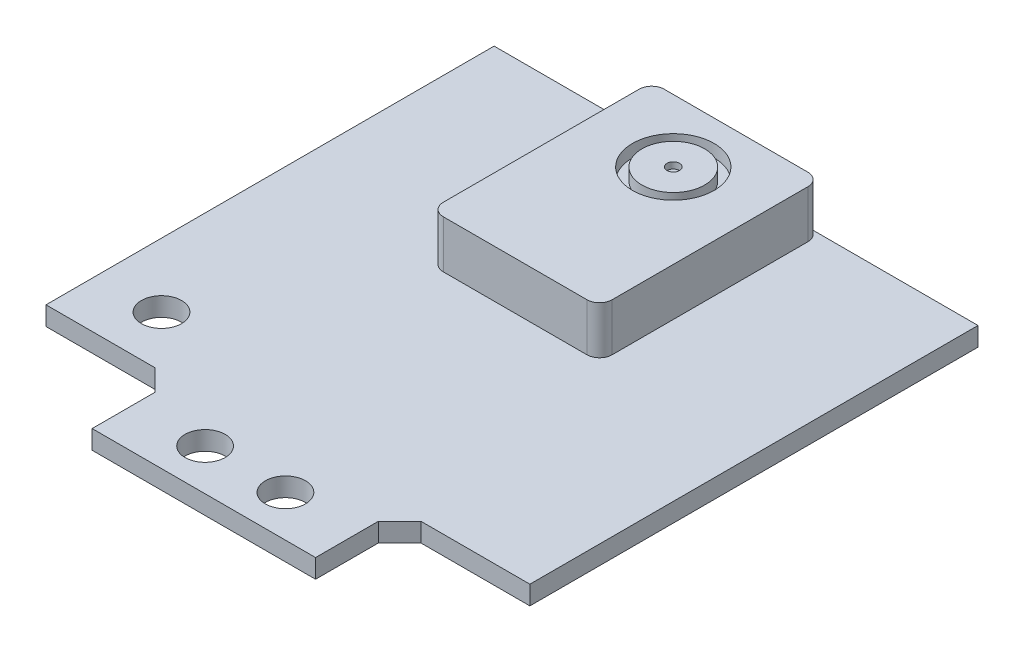
ISO-10303-21;
HEADER;
FILE_DESCRIPTION(('STEP AP214'),'2;1');
FILE_NAME('part.step','',(''),(''),'','','');
FILE_SCHEMA(('AUTOMOTIVE_DESIGN { 1 0 10303 214 1 1 1 1 }'));
ENDSEC;
DATA;
#1=APPLICATION_CONTEXT('core data for automotive mechanical design processes');
#2=APPLICATION_PROTOCOL_DEFINITION('international standard','automotive_design',2000,#1);
#3=PRODUCT_CONTEXT('',#1,'mechanical');
#4=PRODUCT('Part','Part','',(#3));
#5=PRODUCT_RELATED_PRODUCT_CATEGORY('part','',(#4));
#6=PRODUCT_DEFINITION_FORMATION('','',#4);
#7=PRODUCT_DEFINITION_CONTEXT('part definition',#1,'design');
#8=PRODUCT_DEFINITION('design','',#6,#7);
#9=PRODUCT_DEFINITION_SHAPE('','',#8);
#10=(LENGTH_UNIT() NAMED_UNIT(*) SI_UNIT(.MILLI.,.METRE.));
#11=(NAMED_UNIT(*) PLANE_ANGLE_UNIT() SI_UNIT($,.RADIAN.));
#12=(NAMED_UNIT(*) SI_UNIT($,.STERADIAN.) SOLID_ANGLE_UNIT());
#13=UNCERTAINTY_MEASURE_WITH_UNIT(LENGTH_MEASURE(1.E-05),#10,'distance_accuracy_value','');
#14=(GEOMETRIC_REPRESENTATION_CONTEXT(3) GLOBAL_UNCERTAINTY_ASSIGNED_CONTEXT((#13)) GLOBAL_UNIT_ASSIGNED_CONTEXT((#10,
#11,#12)) REPRESENTATION_CONTEXT('',''));
#15=CARTESIAN_POINT('',(0.,0.,0.));
#16=DIRECTION('',(0.,0.,1.));
#17=DIRECTION('',(1.,0.,0.));
#18=AXIS2_PLACEMENT_3D('',#15,#16,#17);
#19=CARTESIAN_POINT('',(0.,0.,0.));
#20=DIRECTION('',(0.,-1.,0.));
#21=DIRECTION('',(0.,0.,-1.));
#22=AXIS2_PLACEMENT_3D('',#19,#20,#21);
#23=PLANE('',#22);
#24=CARTESIAN_POINT('',(-3.19999999999999,0.,21.25));
#25=DIRECTION('',(0.,-1.,0.));
#26=DIRECTION('',(0.,0.,-1.));
#27=AXIS2_PLACEMENT_3D('',#24,#25,#26);
#28=CIRCLE('',#27,1.6);
#29=CARTESIAN_POINT('',(-3.19999999999999,0.,19.65));
#30=VERTEX_POINT('',#29);
#31=EDGE_CURVE('P0_E127',#30,#30,#28,.F.);
#32=ORIENTED_EDGE('',*,*,#31,.T.);
#33=EDGE_LOOP('',(#32));
#34=FACE_BOUND('',#33,.T.);
#35=DIRECTION('',(-1.,0.,0.));
#36=VECTOR('',#35,1.);
#37=CARTESIAN_POINT('',(-19.275,0.,17.85));
#38=LINE('',#37,#36);
#39=CARTESIAN_POINT('',(-10.6,0.,17.85));
#40=VERTEX_POINT('',#39);
#41=CARTESIAN_POINT('',(-19.275,0.,17.85));
#42=VERTEX_POINT('',#41);
#43=EDGE_CURVE('P0_E144',#40,#42,#38,.T.);
#44=ORIENTED_EDGE('',*,*,#43,.T.);
#45=DIRECTION('',(0.,0.,-1.));
#46=VECTOR('',#45,1.);
#47=CARTESIAN_POINT('',(-19.275,0.,-17.85));
#48=LINE('',#47,#46);
#49=CARTESIAN_POINT('',(-19.275,0.,-17.85));
#50=VERTEX_POINT('',#49);
#51=EDGE_CURVE('P0_E139',#42,#50,#48,.T.);
#52=ORIENTED_EDGE('',*,*,#51,.T.);
#53=DIRECTION('',(-1.,0.,0.));
#54=VECTOR('',#53,1.);
#55=CARTESIAN_POINT('',(-19.275,0.,-17.85));
#56=LINE('',#55,#54);
#57=CARTESIAN_POINT('',(19.275,0.,-17.85));
#58=VERTEX_POINT('',#57);
#59=EDGE_CURVE('P0_E109',#58,#50,#56,.T.);
#60=ORIENTED_EDGE('',*,*,#59,.F.);
#61=DIRECTION('',(0.,0.,-1.));
#62=VECTOR('',#61,1.);
#63=CARTESIAN_POINT('',(19.275,0.,-17.85));
#64=LINE('',#63,#62);
#65=CARTESIAN_POINT('',(19.275,0.,17.85));
#66=VERTEX_POINT('',#65);
#67=EDGE_CURVE('P0_E104',#66,#58,#64,.T.);
#68=ORIENTED_EDGE('',*,*,#67,.F.);
#69=DIRECTION('',(1.,0.,0.));
#70=VECTOR('',#69,1.);
#71=CARTESIAN_POINT('',(19.275,0.,17.85));
#72=LINE('',#71,#70);
#73=CARTESIAN_POINT('',(10.6,0.,17.85));
#74=VERTEX_POINT('',#73);
#75=EDGE_CURVE('P0_E95',#74,#66,#72,.T.);
#76=ORIENTED_EDGE('',*,*,#75,.F.);
#77=DIRECTION('',(0.707106781186547,0.,-0.707106781186548));
#78=VECTOR('',#77,1.);
#79=CARTESIAN_POINT('',(10.6,0.,17.85));
#80=LINE('',#79,#78);
#81=CARTESIAN_POINT('',(8.90000000000001,0.,19.55));
#82=VERTEX_POINT('',#81);
#83=EDGE_CURVE('P0_E90',#82,#74,#80,.T.);
#84=ORIENTED_EDGE('',*,*,#83,.F.);
#85=DIRECTION('',(0.,0.,-1.));
#86=VECTOR('',#85,1.);
#87=CARTESIAN_POINT('',(8.90000000000001,0.,19.55));
#88=LINE('',#87,#86);
#89=CARTESIAN_POINT('',(8.90000000000001,0.,24.55));
#90=VERTEX_POINT('',#89);
#91=EDGE_CURVE('P0_E166',#90,#82,#88,.T.);
#92=ORIENTED_EDGE('',*,*,#91,.F.);
#93=DIRECTION('',(-1.,0.,0.));
#94=VECTOR('',#93,1.);
#95=CARTESIAN_POINT('',(-8.89999999999999,0.,24.55));
#96=LINE('',#95,#94);
#97=CARTESIAN_POINT('',(-8.89999999999999,0.,24.55));
#98=VERTEX_POINT('',#97);
#99=EDGE_CURVE('P0_E159',#90,#98,#96,.T.);
#100=ORIENTED_EDGE('',*,*,#99,.T.);
#101=DIRECTION('',(0.,0.,-1.));
#102=VECTOR('',#101,1.);
#103=CARTESIAN_POINT('',(-8.9,0.,19.55));
#104=LINE('',#103,#102);
#105=CARTESIAN_POINT('',(-8.9,0.,19.55));
#106=VERTEX_POINT('',#105);
#107=EDGE_CURVE('P0_E154',#98,#106,#104,.T.);
#108=ORIENTED_EDGE('',*,*,#107,.T.);
#109=DIRECTION('',(-0.707106781186547,0.,-0.707106781186548));
#110=VECTOR('',#109,1.);
#111=CARTESIAN_POINT('',(-10.6,0.,17.85));
#112=LINE('',#111,#110);
#113=EDGE_CURVE('P0_E149',#106,#40,#112,.T.);
#114=ORIENTED_EDGE('',*,*,#113,.T.);
#115=EDGE_LOOP('',(#44,#52,#60,#68,#76,#84,#92,#100,#108,#114));
#116=FACE_BOUND('',#115,.T.);
#117=CARTESIAN_POINT('',(-14.175,0.,13.75));
#118=DIRECTION('',(0.,-1.,0.));
#119=DIRECTION('',(0.,0.,-1.));
#120=AXIS2_PLACEMENT_3D('',#117,#118,#119);
#121=CIRCLE('',#120,1.6);
#122=CARTESIAN_POINT('',(-14.175,0.,12.15));
#123=VERTEX_POINT('',#122);
#124=EDGE_CURVE('P0_E129',#123,#123,#121,.F.);
#125=ORIENTED_EDGE('',*,*,#124,.T.);
#126=EDGE_LOOP('',(#125));
#127=FACE_BOUND('',#126,.T.);
#128=CARTESIAN_POINT('',(3.20000000000001,0.,21.25));
#129=DIRECTION('',(0.,-1.,0.));
#130=DIRECTION('',(0.,0.,-1.));
#131=AXIS2_PLACEMENT_3D('',#128,#129,#130);
#132=CIRCLE('',#131,1.6);
#133=CARTESIAN_POINT('',(3.20000000000001,0.,19.65));
#134=VERTEX_POINT('',#133);
#135=EDGE_CURVE('P0_E19',#134,#134,#132,.F.);
#136=ORIENTED_EDGE('',*,*,#135,.T.);
#137=EDGE_LOOP('',(#136));
#138=FACE_BOUND('',#137,.T.);
#139=ADVANCED_FACE('P0_F16',(#34,#116,#127,#138),#23,.T.);
#140=CARTESIAN_POINT('',(3.20000000000001,1.5,21.25));
#141=DIRECTION('',(0.,-1.,0.));
#142=DIRECTION('',(0.,0.,-1.));
#143=AXIS2_PLACEMENT_3D('',#140,#141,#142);
#144=CYLINDRICAL_SURFACE('',#143,1.6);
#145=CARTESIAN_POINT('',(3.20000000000001,1.5,21.25));
#146=DIRECTION('',(0.,-1.,0.));
#147=DIRECTION('',(0.,0.,-1.));
#148=AXIS2_PLACEMENT_3D('',#145,#146,#147);
#149=CIRCLE('',#148,1.6);
#150=CARTESIAN_POINT('',(3.20000000000001,1.5,19.65));
#151=VERTEX_POINT('',#150);
#152=EDGE_CURVE('P0_E124',#151,#151,#149,.F.);
#153=ORIENTED_EDGE('',*,*,#152,.T.);
#154=EDGE_LOOP('',(#153));
#155=FACE_BOUND('',#154,.T.);
#156=ORIENTED_EDGE('',*,*,#135,.F.);
#157=EDGE_LOOP('',(#156));
#158=FACE_BOUND('',#157,.T.);
#159=ADVANCED_FACE('P0_F334',(#155,#158),#144,.F.);
#160=CARTESIAN_POINT('',(19.275,1.5,-17.85));
#161=DIRECTION('',(1.,0.,0.));
#162=DIRECTION('',(0.,0.,-1.));
#163=AXIS2_PLACEMENT_3D('',#160,#161,#162);
#164=PLANE('',#163);
#165=DIRECTION('',(0.,0.,-1.));
#166=VECTOR('',#165,1.);
#167=CARTESIAN_POINT('',(19.275,1.5,0.));
#168=LINE('',#167,#166);
#169=CARTESIAN_POINT('',(19.275,1.5,-17.85));
#170=VERTEX_POINT('',#169);
#171=CARTESIAN_POINT('',(19.275,1.5,17.85));
#172=VERTEX_POINT('',#171);
#173=EDGE_CURVE('P0_E116',#170,#172,#168,.F.);
#174=ORIENTED_EDGE('',*,*,#173,.T.);
#175=DIRECTION('',(0.,1.,0.));
#176=VECTOR('',#175,1.);
#177=CARTESIAN_POINT('',(19.275,1.5,17.85));
#178=LINE('',#177,#176);
#179=EDGE_CURVE('P0_E100',#66,#172,#178,.T.);
#180=ORIENTED_EDGE('',*,*,#179,.F.);
#181=ORIENTED_EDGE('',*,*,#67,.T.);
#182=DIRECTION('',(0.,1.,0.));
#183=VECTOR('',#182,1.);
#184=CARTESIAN_POINT('',(19.275,1.5,-17.85));
#185=LINE('',#184,#183);
#186=EDGE_CURVE('P0_E131',#170,#58,#185,.F.);
#187=ORIENTED_EDGE('',*,*,#186,.F.);
#188=EDGE_LOOP('',(#174,#180,#181,#187));
#189=FACE_BOUND('',#188,.T.);
#190=ADVANCED_FACE('P0_F115',(#189),#164,.T.);
#191=CARTESIAN_POINT('',(19.275,1.5,17.85));
#192=DIRECTION('',(0.,0.,1.));
#193=DIRECTION('',(1.,0.,0.));
#194=AXIS2_PLACEMENT_3D('',#191,#192,#193);
#195=PLANE('',#194);
#196=DIRECTION('',(1.,0.,0.));
#197=VECTOR('',#196,1.);
#198=CARTESIAN_POINT('',(0.,1.5,17.85));
#199=LINE('',#198,#197);
#200=CARTESIAN_POINT('',(10.6,1.5,17.85));
#201=VERTEX_POINT('',#200);
#202=EDGE_CURVE('P0_E176',#172,#201,#199,.F.);
#203=ORIENTED_EDGE('',*,*,#202,.T.);
#204=DIRECTION('',(0.,1.,0.));
#205=VECTOR('',#204,1.);
#206=CARTESIAN_POINT('',(10.6,1.5,17.85));
#207=LINE('',#206,#205);
#208=EDGE_CURVE('P0_E102',#74,#201,#207,.T.);
#209=ORIENTED_EDGE('',*,*,#208,.F.);
#210=ORIENTED_EDGE('',*,*,#75,.T.);
#211=ORIENTED_EDGE('',*,*,#179,.T.);
#212=EDGE_LOOP('',(#203,#209,#210,#211));
#213=FACE_BOUND('',#212,.T.);
#214=ADVANCED_FACE('P0_F98',(#213),#195,.T.);
#215=CARTESIAN_POINT('',(10.6,1.5,17.85));
#216=DIRECTION('',(0.707106781186548,0.,0.707106781186547));
#217=DIRECTION('',(0.707106781186547,0.,-0.707106781186548));
#218=AXIS2_PLACEMENT_3D('',#215,#216,#217);
#219=PLANE('',#218);
#220=DIRECTION('',(-0.707106781186547,0.,0.707106781186548));
#221=VECTOR('',#220,1.);
#222=CARTESIAN_POINT('',(10.6,1.5,17.85));
#223=LINE('',#222,#221);
#224=CARTESIAN_POINT('',(8.90000000000001,1.5,19.55));
#225=VERTEX_POINT('',#224);
#226=EDGE_CURVE('P0_E170',#201,#225,#223,.T.);
#227=ORIENTED_EDGE('',*,*,#226,.T.);
#228=DIRECTION('',(0.,1.,0.));
#229=VECTOR('',#228,1.);
#230=CARTESIAN_POINT('',(8.90000000000001,1.5,19.55));
#231=LINE('',#230,#229);
#232=EDGE_CURVE('P0_E164',#82,#225,#231,.T.);
#233=ORIENTED_EDGE('',*,*,#232,.F.);
#234=ORIENTED_EDGE('',*,*,#83,.T.);
#235=ORIENTED_EDGE('',*,*,#208,.T.);
#236=EDGE_LOOP('',(#227,#233,#234,#235));
#237=FACE_BOUND('',#236,.T.);
#238=ADVANCED_FACE('P0_F169',(#237),#219,.T.);
#239=CARTESIAN_POINT('',(8.90000000000001,1.5,19.55));
#240=DIRECTION('',(1.,0.,0.));
#241=DIRECTION('',(0.,0.,-1.));
#242=AXIS2_PLACEMENT_3D('',#239,#240,#241);
#243=PLANE('',#242);
#244=DIRECTION('',(0.,0.,-1.));
#245=VECTOR('',#244,1.);
#246=CARTESIAN_POINT('',(8.90000000000001,1.5,0.));
#247=LINE('',#246,#245);
#248=CARTESIAN_POINT('',(8.90000000000001,1.5,24.55));
#249=VERTEX_POINT('',#248);
#250=EDGE_CURVE('P0_E179',#225,#249,#247,.F.);
#251=ORIENTED_EDGE('',*,*,#250,.T.);
#252=DIRECTION('',(0.,1.,0.));
#253=VECTOR('',#252,1.);
#254=CARTESIAN_POINT('',(8.90000000000001,1.5,24.55));
#255=LINE('',#254,#253);
#256=EDGE_CURVE('P0_E161',#249,#90,#255,.F.);
#257=ORIENTED_EDGE('',*,*,#256,.T.);
#258=ORIENTED_EDGE('',*,*,#91,.T.);
#259=ORIENTED_EDGE('',*,*,#232,.T.);
#260=EDGE_LOOP('',(#251,#257,#258,#259));
#261=FACE_BOUND('',#260,.T.);
#262=ADVANCED_FACE('P0_F218',(#261),#243,.T.);
#263=CARTESIAN_POINT('',(-8.89999999999999,1.5,24.55));
#264=DIRECTION('',(0.,0.,-1.));
#265=DIRECTION('',(-1.,0.,0.));
#266=AXIS2_PLACEMENT_3D('',#263,#264,#265);
#267=PLANE('',#266);
#268=ORIENTED_EDGE('',*,*,#256,.F.);
#269=DIRECTION('',(1.,0.,0.));
#270=VECTOR('',#269,1.);
#271=CARTESIAN_POINT('',(0.,1.5,24.55));
#272=LINE('',#271,#270);
#273=CARTESIAN_POINT('',(-8.89999999999999,1.5,24.55));
#274=VERTEX_POINT('',#273);
#275=EDGE_CURVE('P0_E183',#249,#274,#272,.F.);
#276=ORIENTED_EDGE('',*,*,#275,.T.);
#277=DIRECTION('',(0.,1.,0.));
#278=VECTOR('',#277,1.);
#279=CARTESIAN_POINT('',(-8.89999999999999,1.5,24.55));
#280=LINE('',#279,#278);
#281=EDGE_CURVE('P0_E156',#274,#98,#280,.F.);
#282=ORIENTED_EDGE('',*,*,#281,.T.);
#283=ORIENTED_EDGE('',*,*,#99,.F.);
#284=EDGE_LOOP('',(#268,#276,#282,#283));
#285=FACE_BOUND('',#284,.T.);
#286=ADVANCED_FACE('P0_F215',(#285),#267,.F.);
#287=CARTESIAN_POINT('',(-8.9,1.5,19.55));
#288=DIRECTION('',(1.,0.,0.));
#289=DIRECTION('',(0.,0.,-1.));
#290=AXIS2_PLACEMENT_3D('',#287,#288,#289);
#291=PLANE('',#290);
#292=ORIENTED_EDGE('',*,*,#281,.F.);
#293=DIRECTION('',(0.,0.,-1.));
#294=VECTOR('',#293,1.);
#295=CARTESIAN_POINT('',(-8.89999999999999,1.5,0.));
#296=LINE('',#295,#294);
#297=CARTESIAN_POINT('',(-8.9,1.5,19.55));
#298=VERTEX_POINT('',#297);
#299=EDGE_CURVE('P0_E186',#274,#298,#296,.T.);
#300=ORIENTED_EDGE('',*,*,#299,.T.);
#301=DIRECTION('',(0.,1.,0.));
#302=VECTOR('',#301,1.);
#303=CARTESIAN_POINT('',(-8.9,1.5,19.55));
#304=LINE('',#303,#302);
#305=EDGE_CURVE('P0_E151',#298,#106,#304,.F.);
#306=ORIENTED_EDGE('',*,*,#305,.T.);
#307=ORIENTED_EDGE('',*,*,#107,.F.);
#308=EDGE_LOOP('',(#292,#300,#306,#307));
#309=FACE_BOUND('',#308,.T.);
#310=ADVANCED_FACE('P0_F213',(#309),#291,.F.);
#311=CARTESIAN_POINT('',(-10.6,1.5,17.85));
#312=DIRECTION('',(0.707106781186548,0.,-0.707106781186547));
#313=DIRECTION('',(-0.707106781186547,0.,-0.707106781186548));
#314=AXIS2_PLACEMENT_3D('',#311,#312,#313);
#315=PLANE('',#314);
#316=ORIENTED_EDGE('',*,*,#305,.F.);
#317=DIRECTION('',(-0.707106781186547,0.,-0.707106781186548));
#318=VECTOR('',#317,1.);
#319=CARTESIAN_POINT('',(-8.9,1.5,19.55));
#320=LINE('',#319,#318);
#321=CARTESIAN_POINT('',(-10.6,1.5,17.85));
#322=VERTEX_POINT('',#321);
#323=EDGE_CURVE('P0_E189',#298,#322,#320,.T.);
#324=ORIENTED_EDGE('',*,*,#323,.T.);
#325=DIRECTION('',(0.,1.,0.));
#326=VECTOR('',#325,1.);
#327=CARTESIAN_POINT('',(-10.6,1.5,17.85));
#328=LINE('',#327,#326);
#329=EDGE_CURVE('P0_E146',#322,#40,#328,.F.);
#330=ORIENTED_EDGE('',*,*,#329,.T.);
#331=ORIENTED_EDGE('',*,*,#113,.F.);
#332=EDGE_LOOP('',(#316,#324,#330,#331));
#333=FACE_BOUND('',#332,.T.);
#334=ADVANCED_FACE('P0_F209',(#333),#315,.F.);
#335=CARTESIAN_POINT('',(-19.275,1.5,17.85));
#336=DIRECTION('',(0.,0.,-1.));
#337=DIRECTION('',(-1.,0.,0.));
#338=AXIS2_PLACEMENT_3D('',#335,#336,#337);
#339=PLANE('',#338);
#340=ORIENTED_EDGE('',*,*,#329,.F.);
#341=DIRECTION('',(1.,0.,0.));
#342=VECTOR('',#341,1.);
#343=CARTESIAN_POINT('',(0.,1.5,17.85));
#344=LINE('',#343,#342);
#345=CARTESIAN_POINT('',(-19.275,1.5,17.85));
#346=VERTEX_POINT('',#345);
#347=EDGE_CURVE('P0_E192',#322,#346,#344,.F.);
#348=ORIENTED_EDGE('',*,*,#347,.T.);
#349=DIRECTION('',(0.,1.,0.));
#350=VECTOR('',#349,1.);
#351=CARTESIAN_POINT('',(-19.275,1.5,17.85));
#352=LINE('',#351,#350);
#353=EDGE_CURVE('P0_E141',#346,#42,#352,.F.);
#354=ORIENTED_EDGE('',*,*,#353,.T.);
#355=ORIENTED_EDGE('',*,*,#43,.F.);
#356=EDGE_LOOP('',(#340,#348,#354,#355));
#357=FACE_BOUND('',#356,.T.);
#358=ADVANCED_FACE('P0_F205',(#357),#339,.F.);
#359=CARTESIAN_POINT('',(-19.275,1.5,-17.85));
#360=DIRECTION('',(1.,0.,0.));
#361=DIRECTION('',(0.,0.,-1.));
#362=AXIS2_PLACEMENT_3D('',#359,#360,#361);
#363=PLANE('',#362);
#364=ORIENTED_EDGE('',*,*,#353,.F.);
#365=DIRECTION('',(0.,0.,-1.));
#366=VECTOR('',#365,1.);
#367=CARTESIAN_POINT('',(-19.275,1.5,0.));
#368=LINE('',#367,#366);
#369=CARTESIAN_POINT('',(-19.275,1.5,-17.85));
#370=VERTEX_POINT('',#369);
#371=EDGE_CURVE('P0_E195',#346,#370,#368,.T.);
#372=ORIENTED_EDGE('',*,*,#371,.T.);
#373=DIRECTION('',(0.,1.,0.));
#374=VECTOR('',#373,1.);
#375=CARTESIAN_POINT('',(-19.275,1.5,-17.85));
#376=LINE('',#375,#374);
#377=EDGE_CURVE('P0_E34',#50,#370,#376,.T.);
#378=ORIENTED_EDGE('',*,*,#377,.F.);
#379=ORIENTED_EDGE('',*,*,#51,.F.);
#380=EDGE_LOOP('',(#364,#372,#378,#379));
#381=FACE_BOUND('',#380,.T.);
#382=ADVANCED_FACE('P0_F201',(#381),#363,.F.);
#383=CARTESIAN_POINT('',(-19.275,1.5,-17.85));
#384=DIRECTION('',(0.,0.,-1.));
#385=DIRECTION('',(-1.,0.,0.));
#386=AXIS2_PLACEMENT_3D('',#383,#384,#385);
#387=PLANE('',#386);
#388=DIRECTION('',(1.,0.,0.));
#389=VECTOR('',#388,1.);
#390=CARTESIAN_POINT('',(0.,1.5,-17.85));
#391=LINE('',#390,#389);
#392=EDGE_CURVE('P0_E123',#370,#170,#391,.T.);
#393=ORIENTED_EDGE('',*,*,#392,.T.);
#394=ORIENTED_EDGE('',*,*,#186,.T.);
#395=ORIENTED_EDGE('',*,*,#59,.T.);
#396=ORIENTED_EDGE('',*,*,#377,.T.);
#397=EDGE_LOOP('',(#393,#394,#395,#396));
#398=FACE_BOUND('',#397,.T.);
#399=ADVANCED_FACE('P0_F198',(#398),#387,.T.);
#400=CARTESIAN_POINT('',(-14.175,1.5,13.75));
#401=DIRECTION('',(0.,-1.,0.));
#402=DIRECTION('',(0.,0.,-1.));
#403=AXIS2_PLACEMENT_3D('',#400,#401,#402);
#404=CYLINDRICAL_SURFACE('',#403,1.6);
#405=ORIENTED_EDGE('',*,*,#124,.F.);
#406=EDGE_LOOP('',(#405));
#407=FACE_BOUND('',#406,.T.);
#408=CARTESIAN_POINT('',(-14.175,1.5,13.75));
#409=DIRECTION('',(0.,-1.,0.));
#410=DIRECTION('',(0.,0.,-1.));
#411=AXIS2_PLACEMENT_3D('',#408,#409,#410);
#412=CIRCLE('',#411,1.6);
#413=CARTESIAN_POINT('',(-14.175,1.5,12.15));
#414=VERTEX_POINT('',#413);
#415=EDGE_CURVE('P0_E25',#414,#414,#412,.F.);
#416=ORIENTED_EDGE('',*,*,#415,.T.);
#417=EDGE_LOOP('',(#416));
#418=FACE_BOUND('',#417,.T.);
#419=ADVANCED_FACE('P0_F235',(#407,#418),#404,.F.);
#420=CARTESIAN_POINT('',(-3.19999999999999,1.5,21.25));
#421=DIRECTION('',(0.,-1.,0.));
#422=DIRECTION('',(0.,0.,-1.));
#423=AXIS2_PLACEMENT_3D('',#420,#421,#422);
#424=CYLINDRICAL_SURFACE('',#423,1.6);
#425=ORIENTED_EDGE('',*,*,#31,.F.);
#426=EDGE_LOOP('',(#425));
#427=FACE_BOUND('',#426,.T.);
#428=CARTESIAN_POINT('',(-3.19999999999999,1.5,21.25));
#429=DIRECTION('',(0.,-1.,0.));
#430=DIRECTION('',(0.,0.,-1.));
#431=AXIS2_PLACEMENT_3D('',#428,#429,#430);
#432=CIRCLE('',#431,1.6);
#433=CARTESIAN_POINT('',(-3.19999999999999,1.5,19.65));
#434=VERTEX_POINT('',#433);
#435=EDGE_CURVE('P0_E11',#434,#434,#432,.F.);
#436=ORIENTED_EDGE('',*,*,#435,.T.);
#437=EDGE_LOOP('',(#436));
#438=FACE_BOUND('',#437,.T.);
#439=ADVANCED_FACE('P0_F229',(#427,#438),#424,.F.);
#440=CARTESIAN_POINT('',(0.,1.5,0.));
#441=DIRECTION('',(0.,-1.,0.));
#442=DIRECTION('',(0.,0.,-1.));
#443=AXIS2_PLACEMENT_3D('',#440,#441,#442);
#444=PLANE('',#443);
#445=ORIENTED_EDGE('',*,*,#435,.F.);
#446=EDGE_LOOP('',(#445));
#447=FACE_BOUND('',#446,.T.);
#448=ORIENTED_EDGE('',*,*,#415,.F.);
#449=EDGE_LOOP('',(#448));
#450=FACE_BOUND('',#449,.T.);
#451=ORIENTED_EDGE('',*,*,#371,.F.);
#452=ORIENTED_EDGE('',*,*,#347,.F.);
#453=ORIENTED_EDGE('',*,*,#323,.F.);
#454=ORIENTED_EDGE('',*,*,#299,.F.);
#455=ORIENTED_EDGE('',*,*,#275,.F.);
#456=ORIENTED_EDGE('',*,*,#250,.F.);
#457=ORIENTED_EDGE('',*,*,#226,.F.);
#458=ORIENTED_EDGE('',*,*,#202,.F.);
#459=ORIENTED_EDGE('',*,*,#173,.F.);
#460=ORIENTED_EDGE('',*,*,#392,.F.);
#461=EDGE_LOOP('',(#451,#452,#453,#454,#455,#456,#457,#458,#459,#460));
#462=FACE_BOUND('',#461,.T.);
#463=ORIENTED_EDGE('',*,*,#152,.F.);
#464=EDGE_LOOP('',(#463));
#465=FACE_BOUND('',#464,.T.);
#466=ADVANCED_FACE('P0_F174',(#447,#450,#462,#465),#444,.F.);
#467=CLOSED_SHELL('',(#139,#159,#190,#214,#238,#262,#286,#310,#334,#358,#382,#399,#419,#439,#466));
#468=MANIFOLD_SOLID_BREP('P0_B1',#467);
#469=CARTESIAN_POINT('',(0.,4.8,-12.85));
#470=DIRECTION('',(0.,1.,0.));
#471=DIRECTION('',(0.,0.,1.));
#472=AXIS2_PLACEMENT_3D('',#469,#470,#471);
#473=PLANE('',#472);
#474=CARTESIAN_POINT('',(0.,4.8,-12.85));
#475=DIRECTION('',(0.,1.,0.));
#476=DIRECTION('',(0.,0.,1.));
#477=AXIS2_PLACEMENT_3D('',#474,#475,#476);
#478=CIRCLE('',#477,0.5);
#479=CARTESIAN_POINT('',(0.,4.8,-12.35));
#480=VERTEX_POINT('',#479);
#481=EDGE_CURVE('P1_E19',#480,#480,#478,.T.);
#482=ORIENTED_EDGE('',*,*,#481,.T.);
#483=EDGE_LOOP('',(#482));
#484=FACE_BOUND('',#483,.T.);
#485=ADVANCED_FACE('P1_F16',(#484),#473,.T.);
#486=CARTESIAN_POINT('',(0.,4.8,-12.85));
#487=DIRECTION('',(0.,1.,0.));
#488=DIRECTION('',(0.,0.,1.));
#489=AXIS2_PLACEMENT_3D('',#486,#487,#488);
#490=CYLINDRICAL_SURFACE('',#489,0.5);
#491=ORIENTED_EDGE('',*,*,#481,.F.);
#492=EDGE_LOOP('',(#491));
#493=FACE_BOUND('',#492,.T.);
#494=CARTESIAN_POINT('',(0.,5.3,-12.85));
#495=DIRECTION('',(0.,1.,0.));
#496=DIRECTION('',(0.,0.,1.));
#497=AXIS2_PLACEMENT_3D('',#494,#495,#496);
#498=CIRCLE('',#497,0.5);
#499=CARTESIAN_POINT('',(0.,5.3,-12.35));
#500=VERTEX_POINT('',#499);
#501=EDGE_CURVE('P1_E151',#500,#500,#498,.T.);
#502=ORIENTED_EDGE('',*,*,#501,.T.);
#503=EDGE_LOOP('',(#502));
#504=FACE_BOUND('',#503,.T.);
#505=ADVANCED_FACE('P1_F159',(#493,#504),#490,.F.);
#506=CARTESIAN_POINT('',(5.725,5.3,-16.85));
#507=DIRECTION('',(0.,-1.,0.));
#508=DIRECTION('',(0.,0.,-1.));
#509=AXIS2_PLACEMENT_3D('',#506,#507,#508);
#510=PLANE('',#509);
#511=CARTESIAN_POINT('',(0.,5.3,-12.85));
#512=DIRECTION('',(0.,1.,0.));
#513=DIRECTION('',(0.,0.,1.));
#514=AXIS2_PLACEMENT_3D('',#511,#512,#513);
#515=CIRCLE('',#514,2.5);
#516=CARTESIAN_POINT('',(0.,5.3,-10.35));
#517=VERTEX_POINT('',#516);
#518=EDGE_CURVE('P1_E149',#517,#517,#515,.F.);
#519=ORIENTED_EDGE('',*,*,#518,.F.);
#520=EDGE_LOOP('',(#519));
#521=FACE_BOUND('',#520,.T.);
#522=ORIENTED_EDGE('',*,*,#501,.F.);
#523=EDGE_LOOP('',(#522));
#524=FACE_BOUND('',#523,.T.);
#525=ADVANCED_FACE('P1_F161',(#521,#524),#510,.F.);
#526=CARTESIAN_POINT('',(0.,4.3,-12.85));
#527=DIRECTION('',(0.,1.,0.));
#528=DIRECTION('',(0.,0.,1.));
#529=AXIS2_PLACEMENT_3D('',#526,#527,#528);
#530=CYLINDRICAL_SURFACE('',#529,2.5);
#531=CARTESIAN_POINT('',(0.,4.3,-12.85));
#532=DIRECTION('',(0.,1.,0.));
#533=DIRECTION('',(0.,0.,1.));
#534=AXIS2_PLACEMENT_3D('',#531,#532,#533);
#535=CIRCLE('',#534,2.5);
#536=CARTESIAN_POINT('',(0.,4.3,-10.35));
#537=VERTEX_POINT('',#536);
#538=EDGE_CURVE('P1_E146',#537,#537,#535,.T.);
#539=ORIENTED_EDGE('',*,*,#538,.T.);
#540=EDGE_LOOP('',(#539));
#541=FACE_BOUND('',#540,.T.);
#542=ORIENTED_EDGE('',*,*,#518,.T.);
#543=EDGE_LOOP('',(#542));
#544=FACE_BOUND('',#543,.T.);
#545=ADVANCED_FACE('P1_F167',(#541,#544),#530,.T.);
#546=CARTESIAN_POINT('',(0.,4.3,-12.85));
#547=DIRECTION('',(0.,-1.,0.));
#548=DIRECTION('',(0.,0.,-1.));
#549=AXIS2_PLACEMENT_3D('',#546,#547,#548);
#550=PLANE('',#549);
#551=ORIENTED_EDGE('',*,*,#538,.F.);
#552=EDGE_LOOP('',(#551));
#553=FACE_BOUND('',#552,.T.);
#554=CARTESIAN_POINT('',(0.,4.3,-12.85));
#555=DIRECTION('',(0.,1.,0.));
#556=DIRECTION('',(0.,0.,1.));
#557=AXIS2_PLACEMENT_3D('',#554,#555,#556);
#558=CIRCLE('',#557,3.25);
#559=CARTESIAN_POINT('',(0.,4.3,-9.6));
#560=VERTEX_POINT('',#559);
#561=EDGE_CURVE('P1_E143',#560,#560,#558,.T.);
#562=ORIENTED_EDGE('',*,*,#561,.T.);
#563=EDGE_LOOP('',(#562));
#564=FACE_BOUND('',#563,.T.);
#565=ADVANCED_FACE('P1_F208',(#553,#564),#550,.F.);
#566=CARTESIAN_POINT('',(0.,4.3,-12.85));
#567=DIRECTION('',(0.,1.,0.));
#568=DIRECTION('',(0.,0.,1.));
#569=AXIS2_PLACEMENT_3D('',#566,#567,#568);
#570=CYLINDRICAL_SURFACE('',#569,3.25);
#571=CARTESIAN_POINT('',(0.,5.3,-12.85));
#572=DIRECTION('',(0.,1.,0.));
#573=DIRECTION('',(0.,0.,1.));
#574=AXIS2_PLACEMENT_3D('',#571,#572,#573);
#575=CIRCLE('',#574,3.25);
#576=CARTESIAN_POINT('',(0.,5.3,-9.6));
#577=VERTEX_POINT('',#576);
#578=EDGE_CURVE('P1_E98',#577,#577,#575,.T.);
#579=ORIENTED_EDGE('',*,*,#578,.T.);
#580=EDGE_LOOP('',(#579));
#581=FACE_BOUND('',#580,.T.);
#582=ORIENTED_EDGE('',*,*,#561,.F.);
#583=EDGE_LOOP('',(#582));
#584=FACE_BOUND('',#583,.T.);
#585=ADVANCED_FACE('P1_F205',(#581,#584),#570,.F.);
#586=CARTESIAN_POINT('',(5.725,5.3,-1.25));
#587=DIRECTION('',(0.,-1.,0.));
#588=DIRECTION('',(0.,0.,-1.));
#589=AXIS2_PLACEMENT_3D('',#586,#587,#588);
#590=CYLINDRICAL_SURFACE('',#589,1.);
#591=CARTESIAN_POINT('',(5.725,5.3,-1.25));
#592=DIRECTION('',(0.,-1.,0.));
#593=DIRECTION('',(0.,0.,-1.));
#594=AXIS2_PLACEMENT_3D('',#591,#592,#593);
#595=CIRCLE('',#594,1.);
#596=CARTESIAN_POINT('',(6.725,5.3,-1.25));
#597=VERTEX_POINT('',#596);
#598=CARTESIAN_POINT('',(5.725,5.3,-0.25));
#599=VERTEX_POINT('',#598);
#600=EDGE_CURVE('P1_E88',#597,#599,#595,.T.);
#601=ORIENTED_EDGE('',*,*,#600,.T.);
#602=DIRECTION('',(0.,1.,0.));
#603=VECTOR('',#602,1.);
#604=CARTESIAN_POINT('',(5.725,5.3,-0.25));
#605=LINE('',#604,#603);
#606=CARTESIAN_POINT('',(5.725,1.5,-0.25));
#607=VERTEX_POINT('',#606);
#608=EDGE_CURVE('P1_E92',#607,#599,#605,.T.);
#609=ORIENTED_EDGE('',*,*,#608,.F.);
#610=CARTESIAN_POINT('',(5.725,1.5,-1.25));
#611=DIRECTION('',(0.,-1.,0.));
#612=DIRECTION('',(0.,0.,-1.));
#613=AXIS2_PLACEMENT_3D('',#610,#611,#612);
#614=CIRCLE('',#613,1.);
#615=CARTESIAN_POINT('',(6.725,1.5,-1.25));
#616=VERTEX_POINT('',#615);
#617=EDGE_CURVE('P1_E54',#607,#616,#614,.F.);
#618=ORIENTED_EDGE('',*,*,#617,.T.);
#619=DIRECTION('',(0.,1.,0.));
#620=VECTOR('',#619,1.);
#621=CARTESIAN_POINT('',(6.725,5.3,-1.25));
#622=LINE('',#621,#620);
#623=EDGE_CURVE('P1_E94',#616,#597,#622,.T.);
#624=ORIENTED_EDGE('',*,*,#623,.T.);
#625=EDGE_LOOP('',(#601,#609,#618,#624));
#626=FACE_BOUND('',#625,.T.);
#627=ADVANCED_FACE('P1_F90',(#626),#590,.T.);
#628=CARTESIAN_POINT('',(-5.725,5.3,-1.25));
#629=DIRECTION('',(0.,-1.,0.));
#630=DIRECTION('',(0.,0.,-1.));
#631=AXIS2_PLACEMENT_3D('',#628,#629,#630);
#632=CYLINDRICAL_SURFACE('',#631,1.);
#633=CARTESIAN_POINT('',(-5.725,5.3,-1.25));
#634=DIRECTION('',(0.,-1.,0.));
#635=DIRECTION('',(0.,0.,-1.));
#636=AXIS2_PLACEMENT_3D('',#633,#634,#635);
#637=CIRCLE('',#636,1.);
#638=CARTESIAN_POINT('',(-5.725,5.3,-0.249999999999999));
#639=VERTEX_POINT('',#638);
#640=CARTESIAN_POINT('',(-6.725,5.3,-1.25));
#641=VERTEX_POINT('',#640);
#642=EDGE_CURVE('P1_E97',#639,#641,#637,.T.);
#643=ORIENTED_EDGE('',*,*,#642,.T.);
#644=DIRECTION('',(0.,1.,0.));
#645=VECTOR('',#644,1.);
#646=CARTESIAN_POINT('',(-6.725,5.3,-1.25));
#647=LINE('',#646,#645);
#648=CARTESIAN_POINT('',(-6.725,1.5,-1.25));
#649=VERTEX_POINT('',#648);
#650=EDGE_CURVE('P1_E120',#649,#641,#647,.T.);
#651=ORIENTED_EDGE('',*,*,#650,.F.);
#652=CARTESIAN_POINT('',(-5.725,1.5,-1.25));
#653=DIRECTION('',(0.,-1.,0.));
#654=DIRECTION('',(0.,0.,-1.));
#655=AXIS2_PLACEMENT_3D('',#652,#653,#654);
#656=CIRCLE('',#655,1.);
#657=CARTESIAN_POINT('',(-5.725,1.5,-0.249999999999999));
#658=VERTEX_POINT('',#657);
#659=EDGE_CURVE('P1_E140',#649,#658,#656,.F.);
#660=ORIENTED_EDGE('',*,*,#659,.T.);
#661=DIRECTION('',(0.,1.,0.));
#662=VECTOR('',#661,1.);
#663=CARTESIAN_POINT('',(-5.725,5.3,-0.249999999999999));
#664=LINE('',#663,#662);
#665=EDGE_CURVE('P1_E108',#639,#658,#664,.F.);
#666=ORIENTED_EDGE('',*,*,#665,.F.);
#667=EDGE_LOOP('',(#643,#651,#660,#666));
#668=FACE_BOUND('',#667,.T.);
#669=ADVANCED_FACE('P1_F199',(#668),#632,.T.);
#670=CARTESIAN_POINT('',(5.725,5.3,-16.85));
#671=DIRECTION('',(0.,-1.,0.));
#672=DIRECTION('',(0.,0.,-1.));
#673=AXIS2_PLACEMENT_3D('',#670,#671,#672);
#674=CYLINDRICAL_SURFACE('',#673,1.);
#675=CARTESIAN_POINT('',(5.725,5.3,-16.85));
#676=DIRECTION('',(0.,-1.,0.));
#677=DIRECTION('',(0.,0.,-1.));
#678=AXIS2_PLACEMENT_3D('',#675,#676,#677);
#679=CIRCLE('',#678,1.);
#680=CARTESIAN_POINT('',(5.725,5.3,-17.85));
#681=VERTEX_POINT('',#680);
#682=CARTESIAN_POINT('',(6.725,5.3,-16.85));
#683=VERTEX_POINT('',#682);
#684=EDGE_CURVE('P1_E134',#681,#683,#679,.T.);
#685=ORIENTED_EDGE('',*,*,#684,.T.);
#686=DIRECTION('',(0.,1.,0.));
#687=VECTOR('',#686,1.);
#688=CARTESIAN_POINT('',(6.725,5.3,-16.85));
#689=LINE('',#688,#687);
#690=CARTESIAN_POINT('',(6.725,1.5,-16.85));
#691=VERTEX_POINT('',#690);
#692=EDGE_CURVE('P1_E112',#683,#691,#689,.F.);
#693=ORIENTED_EDGE('',*,*,#692,.T.);
#694=CARTESIAN_POINT('',(5.725,1.5,-16.85));
#695=DIRECTION('',(0.,-1.,0.));
#696=DIRECTION('',(0.,0.,-1.));
#697=AXIS2_PLACEMENT_3D('',#694,#695,#696);
#698=CIRCLE('',#697,1.);
#699=CARTESIAN_POINT('',(5.725,1.5,-17.85));
#700=VERTEX_POINT('',#699);
#701=EDGE_CURVE('P1_E34',#691,#700,#698,.F.);
#702=ORIENTED_EDGE('',*,*,#701,.T.);
#703=DIRECTION('',(0.,1.,0.));
#704=VECTOR('',#703,1.);
#705=CARTESIAN_POINT('',(5.725,5.3,-17.85));
#706=LINE('',#705,#704);
#707=EDGE_CURVE('P1_E126',#700,#681,#706,.T.);
#708=ORIENTED_EDGE('',*,*,#707,.T.);
#709=EDGE_LOOP('',(#685,#693,#702,#708));
#710=FACE_BOUND('',#709,.T.);
#711=ADVANCED_FACE('P1_F196',(#710),#674,.T.);
#712=CARTESIAN_POINT('',(5.725,5.3,-16.85));
#713=DIRECTION('',(0.,-1.,0.));
#714=DIRECTION('',(0.,0.,-1.));
#715=AXIS2_PLACEMENT_3D('',#712,#713,#714);
#716=PLANE('',#715);
#717=ORIENTED_EDGE('',*,*,#684,.F.);
#718=DIRECTION('',(1.,0.,0.));
#719=VECTOR('',#718,1.);
#720=CARTESIAN_POINT('',(0.,5.3,-17.85));
#721=LINE('',#720,#719);
#722=CARTESIAN_POINT('',(-5.725,5.3,-17.85));
#723=VERTEX_POINT('',#722);
#724=EDGE_CURVE('P1_E67',#681,#723,#721,.F.);
#725=ORIENTED_EDGE('',*,*,#724,.T.);
#726=CARTESIAN_POINT('',(-5.725,5.3,-16.85));
#727=DIRECTION('',(0.,-1.,0.));
#728=DIRECTION('',(0.,0.,-1.));
#729=AXIS2_PLACEMENT_3D('',#726,#727,#728);
#730=CIRCLE('',#729,1.);
#731=CARTESIAN_POINT('',(-6.725,5.3,-16.85));
#732=VERTEX_POINT('',#731);
#733=EDGE_CURVE('P1_E123',#732,#723,#730,.T.);
#734=ORIENTED_EDGE('',*,*,#733,.F.);
#735=DIRECTION('',(0.,0.,1.));
#736=VECTOR('',#735,1.);
#737=CARTESIAN_POINT('',(-6.725,5.3,0.));
#738=LINE('',#737,#736);
#739=EDGE_CURVE('P1_E127',#641,#732,#738,.F.);
#740=ORIENTED_EDGE('',*,*,#739,.F.);
#741=ORIENTED_EDGE('',*,*,#642,.F.);
#742=DIRECTION('',(1.,0.,0.));
#743=VECTOR('',#742,1.);
#744=CARTESIAN_POINT('',(0.,5.3,-0.249999999999999));
#745=LINE('',#744,#743);
#746=EDGE_CURVE('P1_E101',#599,#639,#745,.F.);
#747=ORIENTED_EDGE('',*,*,#746,.F.);
#748=ORIENTED_EDGE('',*,*,#600,.F.);
#749=DIRECTION('',(0.,0.,1.));
#750=VECTOR('',#749,1.);
#751=CARTESIAN_POINT('',(6.725,5.3,0.));
#752=LINE('',#751,#750);
#753=EDGE_CURVE('P1_E114',#597,#683,#752,.F.);
#754=ORIENTED_EDGE('',*,*,#753,.T.);
#755=EDGE_LOOP('',(#717,#725,#734,#740,#741,#747,#748,#754));
#756=FACE_BOUND('',#755,.T.);
#757=ORIENTED_EDGE('',*,*,#578,.F.);
#758=EDGE_LOOP('',(#757));
#759=FACE_BOUND('',#758,.T.);
#760=ADVANCED_FACE('P1_F102',(#756,#759),#716,.F.);
#761=CARTESIAN_POINT('',(-5.725,5.3,-16.85));
#762=DIRECTION('',(0.,-1.,0.));
#763=DIRECTION('',(0.,0.,-1.));
#764=AXIS2_PLACEMENT_3D('',#761,#762,#763);
#765=CYLINDRICAL_SURFACE('',#764,1.);
#766=ORIENTED_EDGE('',*,*,#733,.T.);
#767=DIRECTION('',(0.,1.,0.));
#768=VECTOR('',#767,1.);
#769=CARTESIAN_POINT('',(-5.725,5.3,-17.85));
#770=LINE('',#769,#768);
#771=CARTESIAN_POINT('',(-5.725,1.5,-17.85));
#772=VERTEX_POINT('',#771);
#773=EDGE_CURVE('P1_E125',#723,#772,#770,.F.);
#774=ORIENTED_EDGE('',*,*,#773,.T.);
#775=CARTESIAN_POINT('',(-5.725,1.5,-16.85));
#776=DIRECTION('',(0.,-1.,0.));
#777=DIRECTION('',(0.,0.,-1.));
#778=AXIS2_PLACEMENT_3D('',#775,#776,#777);
#779=CIRCLE('',#778,1.);
#780=CARTESIAN_POINT('',(-6.725,1.5,-16.85));
#781=VERTEX_POINT('',#780);
#782=EDGE_CURVE('P1_E132',#772,#781,#779,.F.);
#783=ORIENTED_EDGE('',*,*,#782,.T.);
#784=DIRECTION('',(0.,1.,0.));
#785=VECTOR('',#784,1.);
#786=CARTESIAN_POINT('',(-6.725,5.3,-16.85));
#787=LINE('',#786,#785);
#788=EDGE_CURVE('P1_E118',#732,#781,#787,.F.);
#789=ORIENTED_EDGE('',*,*,#788,.F.);
#790=EDGE_LOOP('',(#766,#774,#783,#789));
#791=FACE_BOUND('',#790,.T.);
#792=ADVANCED_FACE('P1_F189',(#791),#765,.T.);
#793=CARTESIAN_POINT('',(6.725,5.3,0.));
#794=DIRECTION('',(-1.,0.,0.));
#795=DIRECTION('',(0.,0.,1.));
#796=AXIS2_PLACEMENT_3D('',#793,#794,#795);
#797=PLANE('',#796);
#798=ORIENTED_EDGE('',*,*,#692,.F.);
#799=ORIENTED_EDGE('',*,*,#753,.F.);
#800=ORIENTED_EDGE('',*,*,#623,.F.);
#801=DIRECTION('',(0.,0.,-1.));
#802=VECTOR('',#801,1.);
#803=CARTESIAN_POINT('',(6.725,1.5,-16.85));
#804=LINE('',#803,#802);
#805=EDGE_CURVE('P1_E332',#691,#616,#804,.F.);
#806=ORIENTED_EDGE('',*,*,#805,.F.);
#807=EDGE_LOOP('',(#798,#799,#800,#806));
#808=FACE_BOUND('',#807,.T.);
#809=ADVANCED_FACE('P1_F186',(#808),#797,.F.);
#810=CARTESIAN_POINT('',(0.,5.3,-0.249999999999999));
#811=DIRECTION('',(0.,0.,1.));
#812=DIRECTION('',(1.,0.,0.));
#813=AXIS2_PLACEMENT_3D('',#810,#811,#812);
#814=PLANE('',#813);
#815=ORIENTED_EDGE('',*,*,#746,.T.);
#816=ORIENTED_EDGE('',*,*,#665,.T.);
#817=DIRECTION('',(1.,0.,0.));
#818=VECTOR('',#817,1.);
#819=CARTESIAN_POINT('',(5.725,1.5,-0.25));
#820=LINE('',#819,#818);
#821=EDGE_CURVE('P1_E111',#607,#658,#820,.F.);
#822=ORIENTED_EDGE('',*,*,#821,.F.);
#823=ORIENTED_EDGE('',*,*,#608,.T.);
#824=EDGE_LOOP('',(#815,#816,#822,#823));
#825=FACE_BOUND('',#824,.T.);
#826=ADVANCED_FACE('P1_F110',(#825),#814,.T.);
#827=CARTESIAN_POINT('',(-6.725,5.3,0.));
#828=DIRECTION('',(-1.,0.,0.));
#829=DIRECTION('',(0.,0.,1.));
#830=AXIS2_PLACEMENT_3D('',#827,#828,#829);
#831=PLANE('',#830);
#832=ORIENTED_EDGE('',*,*,#739,.T.);
#833=ORIENTED_EDGE('',*,*,#788,.T.);
#834=DIRECTION('',(0.,0.,-1.));
#835=VECTOR('',#834,1.);
#836=CARTESIAN_POINT('',(-6.725,1.5,-16.85));
#837=LINE('',#836,#835);
#838=EDGE_CURVE('P1_E25',#649,#781,#837,.T.);
#839=ORIENTED_EDGE('',*,*,#838,.F.);
#840=ORIENTED_EDGE('',*,*,#650,.T.);
#841=EDGE_LOOP('',(#832,#833,#839,#840));
#842=FACE_BOUND('',#841,.T.);
#843=ADVANCED_FACE('P1_F177',(#842),#831,.T.);
#844=CARTESIAN_POINT('',(0.,5.3,-17.85));
#845=DIRECTION('',(0.,0.,1.));
#846=DIRECTION('',(1.,0.,0.));
#847=AXIS2_PLACEMENT_3D('',#844,#845,#846);
#848=PLANE('',#847);
#849=ORIENTED_EDGE('',*,*,#773,.F.);
#850=ORIENTED_EDGE('',*,*,#724,.F.);
#851=ORIENTED_EDGE('',*,*,#707,.F.);
#852=DIRECTION('',(1.,0.,0.));
#853=VECTOR('',#852,1.);
#854=CARTESIAN_POINT('',(5.725,1.5,-17.85));
#855=LINE('',#854,#853);
#856=EDGE_CURVE('P1_E11',#772,#700,#855,.T.);
#857=ORIENTED_EDGE('',*,*,#856,.F.);
#858=EDGE_LOOP('',(#849,#850,#851,#857));
#859=FACE_BOUND('',#858,.T.);
#860=ADVANCED_FACE('P1_F172',(#859),#848,.F.);
#861=CARTESIAN_POINT('',(5.725,1.5,-16.85));
#862=DIRECTION('',(0.,-1.,0.));
#863=DIRECTION('',(0.,0.,-1.));
#864=AXIS2_PLACEMENT_3D('',#861,#862,#863);
#865=PLANE('',#864);
#866=ORIENTED_EDGE('',*,*,#856,.T.);
#867=ORIENTED_EDGE('',*,*,#701,.F.);
#868=ORIENTED_EDGE('',*,*,#805,.T.);
#869=ORIENTED_EDGE('',*,*,#617,.F.);
#870=ORIENTED_EDGE('',*,*,#821,.T.);
#871=ORIENTED_EDGE('',*,*,#659,.F.);
#872=ORIENTED_EDGE('',*,*,#838,.T.);
#873=ORIENTED_EDGE('',*,*,#782,.F.);
#874=EDGE_LOOP('',(#866,#867,#868,#869,#870,#871,#872,#873));
#875=FACE_BOUND('',#874,.T.);
#876=ADVANCED_FACE('P1_F170',(#875),#865,.T.);
#877=CLOSED_SHELL('',(#485,#505,#525,#545,#565,#585,#627,#669,#711,#760,#792,#809,#826,#843,
#860,#876));
#878=MANIFOLD_SOLID_BREP('P1_B1',#877);
#879=ADVANCED_BREP_SHAPE_REPRESENTATION('',(#18,#468,#878),#14);
#880=SHAPE_DEFINITION_REPRESENTATION(#9,#879);
ENDSEC;
END-ISO-10303-21;
